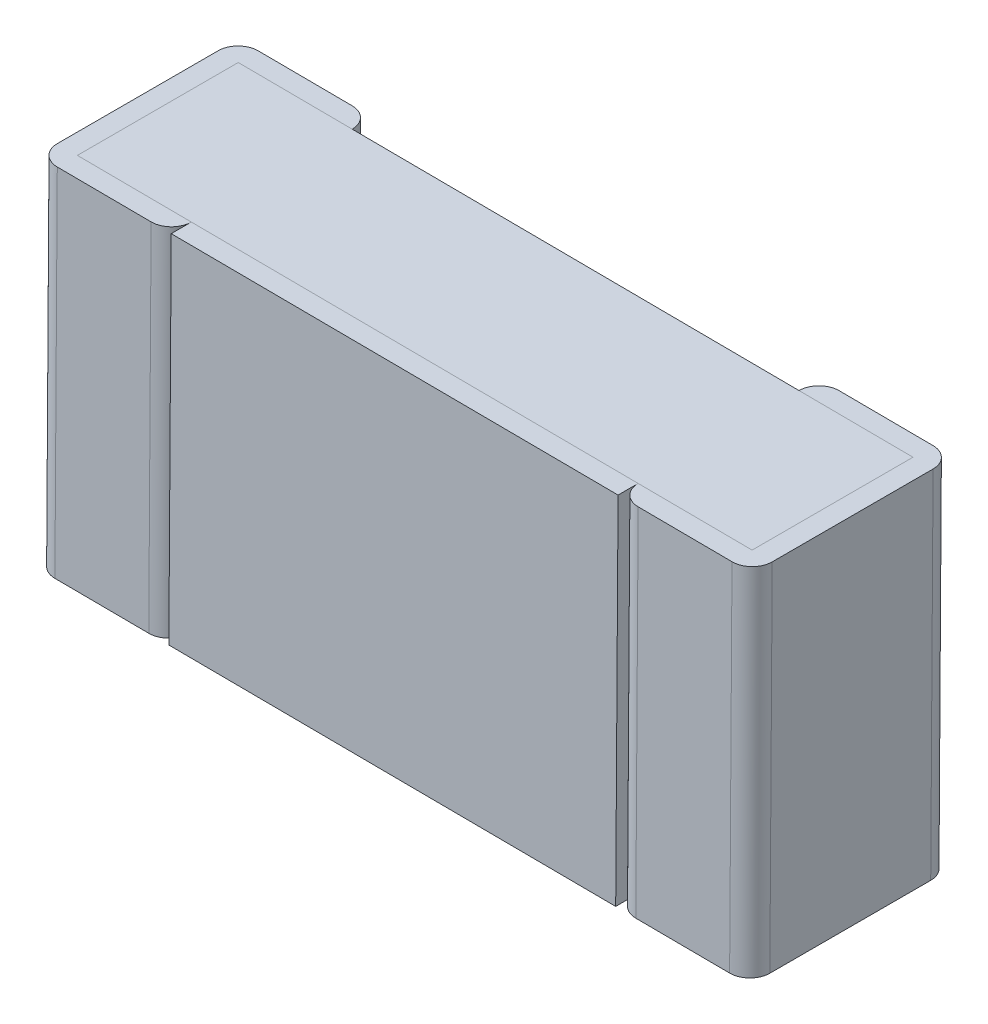
ISO-10303-21;
HEADER;
FILE_DESCRIPTION(('STEP AP214'),'2;1');
FILE_NAME('part.step','',(''),(''),'','','');
FILE_SCHEMA(('AUTOMOTIVE_DESIGN { 1 0 10303 214 1 1 1 1 }'));
ENDSEC;
DATA;
#1=APPLICATION_CONTEXT('core data for automotive mechanical design processes');
#2=APPLICATION_PROTOCOL_DEFINITION('international standard','automotive_design',2000,#1);
#3=PRODUCT_CONTEXT('',#1,'mechanical');
#4=PRODUCT('Part','Part','',(#3));
#5=PRODUCT_RELATED_PRODUCT_CATEGORY('part','',(#4));
#6=PRODUCT_DEFINITION_FORMATION('','',#4);
#7=PRODUCT_DEFINITION_CONTEXT('part definition',#1,'design');
#8=PRODUCT_DEFINITION('design','',#6,#7);
#9=PRODUCT_DEFINITION_SHAPE('','',#8);
#10=(LENGTH_UNIT() NAMED_UNIT(*) SI_UNIT(.MILLI.,.METRE.));
#11=(NAMED_UNIT(*) PLANE_ANGLE_UNIT() SI_UNIT($,.RADIAN.));
#12=(NAMED_UNIT(*) SI_UNIT($,.STERADIAN.) SOLID_ANGLE_UNIT());
#13=UNCERTAINTY_MEASURE_WITH_UNIT(LENGTH_MEASURE(1.E-05),#10,'distance_accuracy_value','');
#14=(GEOMETRIC_REPRESENTATION_CONTEXT(3) GLOBAL_UNCERTAINTY_ASSIGNED_CONTEXT((#13)) GLOBAL_UNIT_ASSIGNED_CONTEXT((#10,
#11,#12)) REPRESENTATION_CONTEXT('',''));
#15=CARTESIAN_POINT('',(0.,0.,0.));
#16=DIRECTION('',(0.,0.,1.));
#17=DIRECTION('',(1.,0.,0.));
#18=AXIS2_PLACEMENT_3D('',#15,#16,#17);
#19=CARTESIAN_POINT('',(212.780631427361,101.305639554933,142.661582908599));
#20=DIRECTION('',(0.,0.,1.));
#21=DIRECTION('',(1.,0.,0.));
#22=AXIS2_PLACEMENT_3D('',#19,#20,#21);
#23=PLANE('',#22);
#24=DIRECTION('',(0.00663069374923689,0.999978016708569,0.));
#25=VECTOR('',#24,1.);
#26=CARTESIAN_POINT('',(212.780631427361,101.305639554933,142.661582908599));
#27=LINE('',#26,#25);
#28=CARTESIAN_POINT('',(212.780631427361,101.305639554933,142.661582908599));
#29=VERTEX_POINT('',#28);
#30=CARTESIAN_POINT('',(212.785935982361,102.1056219683,142.661582908599));
#31=VERTEX_POINT('',#30);
#32=EDGE_CURVE('E66',#29,#31,#27,.T.);
#33=ORIENTED_EDGE('',*,*,#32,.F.);
#34=DIRECTION('',(0.999978016708569,-0.00663069374923689,0.));
#35=VECTOR('',#34,1.);
#36=CARTESIAN_POINT('',(212.780631427361,101.305639554933,142.661582908599));
#37=LINE('',#36,#35);
#38=CARTESIAN_POINT('',(213.780609444069,101.299008861184,142.661582908599));
#39=VERTEX_POINT('',#38);
#40=EDGE_CURVE('E11',#29,#39,#37,.T.);
#41=ORIENTED_EDGE('',*,*,#40,.T.);
#42=DIRECTION('',(0.00663069374923689,0.999978016708569,0.));
#43=VECTOR('',#42,1.);
#44=CARTESIAN_POINT('',(213.780609444069,101.299008861184,142.661582908599));
#45=LINE('',#44,#43);
#46=CARTESIAN_POINT('',(213.785913999069,102.098991274551,142.661582908599));
#47=VERTEX_POINT('',#46);
#48=EDGE_CURVE('E55',#39,#47,#45,.T.);
#49=ORIENTED_EDGE('',*,*,#48,.T.);
#50=DIRECTION('',(0.999978016708569,-0.00663069374923689,0.));
#51=VECTOR('',#50,1.);
#52=CARTESIAN_POINT('',(212.785935982361,102.1056219683,142.661582908599));
#53=LINE('',#52,#51);
#54=EDGE_CURVE('E286',#31,#47,#53,.T.);
#55=ORIENTED_EDGE('',*,*,#54,.F.);
#56=EDGE_LOOP('',(#33,#41,#49,#55));
#57=FACE_BOUND('',#56,.T.);
#58=ADVANCED_FACE('F44',(#57),#23,.T.);
#59=CARTESIAN_POINT('',(213.780609444069,101.299008861184,142.616582908599));
#60=DIRECTION('',(0.99997801670857,-0.00663069374923689,0.));
#61=DIRECTION('',(0.,0.,-1.));
#62=AXIS2_PLACEMENT_3D('',#59,#60,#61);
#63=PLANE('',#62);
#64=DIRECTION('',(0.,0.,1.));
#65=VECTOR('',#64,1.);
#66=CARTESIAN_POINT('',(213.780609444069,101.299008861184,142.616582908599));
#67=LINE('',#66,#65);
#68=CARTESIAN_POINT('',(213.780609444069,101.299008861184,142.616582908599));
#69=VERTEX_POINT('',#68);
#70=EDGE_CURVE('E160',#69,#39,#67,.T.);
#71=ORIENTED_EDGE('',*,*,#70,.F.);
#72=DIRECTION('',(0.00663069374923689,0.999978016708569,0.));
#73=VECTOR('',#72,1.);
#74=CARTESIAN_POINT('',(213.780609444069,101.299008861184,142.616582908599));
#75=LINE('',#74,#73);
#76=CARTESIAN_POINT('',(213.785913999069,102.098991274551,142.616582908599));
#77=VERTEX_POINT('',#76);
#78=EDGE_CURVE('E176',#69,#77,#75,.T.);
#79=ORIENTED_EDGE('',*,*,#78,.T.);
#80=DIRECTION('',(0.,0.,1.));
#81=VECTOR('',#80,1.);
#82=CARTESIAN_POINT('',(213.785913999069,102.098991274551,142.616582908599));
#83=LINE('',#82,#81);
#84=EDGE_CURVE('E198',#77,#47,#83,.T.);
#85=ORIENTED_EDGE('',*,*,#84,.T.);
#86=ORIENTED_EDGE('',*,*,#48,.F.);
#87=EDGE_LOOP('',(#71,#79,#85,#86));
#88=FACE_BOUND('',#87,.T.);
#89=ADVANCED_FACE('F173',(#88),#63,.T.);
#90=CARTESIAN_POINT('',(213.825608454822,101.298710479965,142.616582908599));
#91=DIRECTION('',(0.00663069374931182,0.999978016708569,0.));
#92=DIRECTION('',(-0.999978016708569,0.00663069374931182,0.));
#93=AXIS2_PLACEMENT_3D('',#90,#91,#92);
#94=CYLINDRICAL_SURFACE('',#93,0.0450000000000038);
#95=CARTESIAN_POINT('',(213.825608454822,101.298710479965,142.616582908599));
#96=DIRECTION('',(0.00663069374923689,0.99997801670857,0.));
#97=DIRECTION('',(0.,0.,1.));
#98=AXIS2_PLACEMENT_3D('',#95,#96,#97);
#99=CIRCLE('',#98,0.0449999999999895);
#100=CARTESIAN_POINT('',(213.825608454822,101.298710479965,142.661582908599));
#101=VERTEX_POINT('',#100);
#102=EDGE_CURVE('E185',#69,#101,#99,.T.);
#103=ORIENTED_EDGE('',*,*,#102,.T.);
#104=DIRECTION('',(0.00663069374923689,0.999978016708569,0.));
#105=VECTOR('',#104,1.);
#106=CARTESIAN_POINT('',(213.825608454822,101.298710479965,142.661582908599));
#107=LINE('',#106,#105);
#108=CARTESIAN_POINT('',(213.830913009821,102.098692893332,142.661582908599));
#109=VERTEX_POINT('',#108);
#110=EDGE_CURVE('E199',#101,#109,#107,.T.);
#111=ORIENTED_EDGE('',*,*,#110,.T.);
#112=CARTESIAN_POINT('',(213.830913009821,102.098692893332,142.616582908599));
#113=DIRECTION('',(0.00663069374923689,0.99997801670857,0.));
#114=DIRECTION('',(0.,0.,1.));
#115=AXIS2_PLACEMENT_3D('',#112,#113,#114);
#116=CIRCLE('',#115,0.0449999999999895);
#117=EDGE_CURVE('E203',#77,#109,#116,.T.);
#118=ORIENTED_EDGE('',*,*,#117,.F.);
#119=ORIENTED_EDGE('',*,*,#78,.F.);
#120=EDGE_LOOP('',(#103,#111,#118,#119));
#121=FACE_BOUND('',#120,.T.);
#122=ADVANCED_FACE('F202',(#121),#94,.T.);
#123=CARTESIAN_POINT('',(213.780609444069,101.299008861184,142.661582908599));
#124=DIRECTION('',(0.,0.,1.));
#125=DIRECTION('',(1.,0.,0.));
#126=AXIS2_PLACEMENT_3D('',#123,#124,#125);
#127=PLANE('',#126);
#128=DIRECTION('',(0.999978016708569,-0.00663069374923689,0.));
#129=VECTOR('',#128,1.);
#130=CARTESIAN_POINT('',(213.785913999069,102.098991274551,142.661582908599));
#131=LINE('',#130,#129);
#132=CARTESIAN_POINT('',(214.04090839333,102.097300447645,142.661582908599));
#133=VERTEX_POINT('',#132);
#134=EDGE_CURVE('E260',#109,#133,#131,.T.);
#135=ORIENTED_EDGE('',*,*,#134,.F.);
#136=ORIENTED_EDGE('',*,*,#110,.F.);
#137=DIRECTION('',(0.999978016708569,-0.00663069374923689,0.));
#138=VECTOR('',#137,1.);
#139=CARTESIAN_POINT('',(213.780609444069,101.299008861184,142.661582908599));
#140=LINE('',#139,#138);
#141=CARTESIAN_POINT('',(214.035603838331,101.297318034278,142.661582908599));
#142=VERTEX_POINT('',#141);
#143=EDGE_CURVE('E194',#101,#142,#140,.T.);
#144=ORIENTED_EDGE('',*,*,#143,.T.);
#145=DIRECTION('',(0.00663069374923689,0.999978016708569,0.));
#146=VECTOR('',#145,1.);
#147=CARTESIAN_POINT('',(214.035603838331,101.297318034278,142.661582908599));
#148=LINE('',#147,#146);
#149=EDGE_CURVE('E247',#142,#133,#148,.T.);
#150=ORIENTED_EDGE('',*,*,#149,.T.);
#151=EDGE_LOOP('',(#135,#136,#144,#150));
#152=FACE_BOUND('',#151,.T.);
#153=ADVANCED_FACE('F470',(#152),#127,.T.);
#154=CARTESIAN_POINT('',(214.035603838331,101.297318034278,142.616582908599));
#155=DIRECTION('',(0.00663069374931182,0.999978016708569,0.));
#156=DIRECTION('',(0.999978016708569,-0.00663069374931182,0.));
#157=AXIS2_PLACEMENT_3D('',#154,#155,#156);
#158=CYLINDRICAL_SURFACE('',#157,0.0450000000000038);
#159=DIRECTION('',(0.00663069374923689,0.999978016708569,0.));
#160=VECTOR('',#159,1.);
#161=CARTESIAN_POINT('',(214.080602849082,101.297019653059,142.616582908599));
#162=LINE('',#161,#160);
#163=CARTESIAN_POINT('',(214.080602849082,101.297019653059,142.616582908599));
#164=VERTEX_POINT('',#163);
#165=CARTESIAN_POINT('',(214.085907404082,102.097002066426,142.616582908599));
#166=VERTEX_POINT('',#165);
#167=EDGE_CURVE('E255',#164,#166,#162,.T.);
#168=ORIENTED_EDGE('',*,*,#167,.T.);
#169=CARTESIAN_POINT('',(214.04090839333,102.097300447645,142.616582908599));
#170=DIRECTION('',(-0.00663069374923689,-0.99997801670857,0.));
#171=DIRECTION('',(0.,0.,1.));
#172=AXIS2_PLACEMENT_3D('',#169,#170,#171);
#173=CIRCLE('',#172,0.0449999999999895);
#174=EDGE_CURVE('E312',#166,#133,#173,.T.);
#175=ORIENTED_EDGE('',*,*,#174,.T.);
#176=ORIENTED_EDGE('',*,*,#149,.F.);
#177=CARTESIAN_POINT('',(214.035603838331,101.297318034278,142.616582908599));
#178=DIRECTION('',(-0.00663069374923689,-0.99997801670857,0.));
#179=DIRECTION('',(0.,0.,1.));
#180=AXIS2_PLACEMENT_3D('',#177,#178,#179);
#181=CIRCLE('',#180,0.0449999999999895);
#182=EDGE_CURVE('E212',#164,#142,#181,.T.);
#183=ORIENTED_EDGE('',*,*,#182,.F.);
#184=EDGE_LOOP('',(#168,#175,#176,#183));
#185=FACE_BOUND('',#184,.T.);
#186=ADVANCED_FACE('F461',(#185),#158,.T.);
#187=CARTESIAN_POINT('',(214.080602849082,101.297019653059,142.211582908599));
#188=DIRECTION('',(0.99997801670857,-0.00663069374923689,0.));
#189=DIRECTION('',(0.,0.,-1.));
#190=AXIS2_PLACEMENT_3D('',#187,#188,#189);
#191=PLANE('',#190);
#192=DIRECTION('',(0.,0.,1.));
#193=VECTOR('',#192,1.);
#194=CARTESIAN_POINT('',(214.080602849082,101.297019653059,142.211582908599));
#195=LINE('',#194,#193);
#196=CARTESIAN_POINT('',(214.080602849082,101.297019653059,142.256582908599));
#197=VERTEX_POINT('',#196);
#198=EDGE_CURVE('E168',#197,#164,#195,.T.);
#199=ORIENTED_EDGE('',*,*,#198,.F.);
#200=DIRECTION('',(0.00663069374923689,0.999978016708569,0.));
#201=VECTOR('',#200,1.);
#202=CARTESIAN_POINT('',(214.080602849082,101.297019653059,142.256582908599));
#203=LINE('',#202,#201);
#204=CARTESIAN_POINT('',(214.085907404082,102.097002066426,142.256582908599));
#205=VERTEX_POINT('',#204);
#206=EDGE_CURVE('E316',#197,#205,#203,.T.);
#207=ORIENTED_EDGE('',*,*,#206,.T.);
#208=DIRECTION('',(0.,0.,1.));
#209=VECTOR('',#208,1.);
#210=CARTESIAN_POINT('',(214.085907404082,102.097002066426,142.211582908599));
#211=LINE('',#210,#209);
#212=EDGE_CURVE('E378',#205,#166,#211,.T.);
#213=ORIENTED_EDGE('',*,*,#212,.T.);
#214=ORIENTED_EDGE('',*,*,#167,.F.);
#215=EDGE_LOOP('',(#199,#207,#213,#214));
#216=FACE_BOUND('',#215,.T.);
#217=ADVANCED_FACE('F368',(#216),#191,.T.);
#218=CARTESIAN_POINT('',(214.035603838331,101.297318034278,142.256582908599));
#219=DIRECTION('',(0.00663069374931182,0.999978016708569,0.));
#220=DIRECTION('',(0.999978016708569,-0.00663069374931182,0.));
#221=AXIS2_PLACEMENT_3D('',#218,#219,#220);
#222=CYLINDRICAL_SURFACE('',#221,0.0450000000000038);
#223=CARTESIAN_POINT('',(214.035603838331,101.297318034278,142.256582908599));
#224=DIRECTION('',(0.00663069374923689,0.99997801670857,0.));
#225=DIRECTION('',(0.,0.,1.));
#226=AXIS2_PLACEMENT_3D('',#223,#224,#225);
#227=CIRCLE('',#226,0.0449999999999895);
#228=CARTESIAN_POINT('',(214.035603838331,101.297318034278,142.211582908599));
#229=VERTEX_POINT('',#228);
#230=EDGE_CURVE('E360',#197,#229,#227,.T.);
#231=ORIENTED_EDGE('',*,*,#230,.T.);
#232=DIRECTION('',(0.00663069374923689,0.999978016708569,0.));
#233=VECTOR('',#232,1.);
#234=CARTESIAN_POINT('',(214.035603838331,101.297318034278,142.211582908599));
#235=LINE('',#234,#233);
#236=CARTESIAN_POINT('',(214.04090839333,102.097300447645,142.211582908599));
#237=VERTEX_POINT('',#236);
#238=EDGE_CURVE('E386',#229,#237,#235,.T.);
#239=ORIENTED_EDGE('',*,*,#238,.T.);
#240=CARTESIAN_POINT('',(214.04090839333,102.097300447645,142.256582908599));
#241=DIRECTION('',(0.00663069374923689,0.99997801670857,0.));
#242=DIRECTION('',(0.,0.,1.));
#243=AXIS2_PLACEMENT_3D('',#240,#241,#242);
#244=CIRCLE('',#243,0.0449999999999895);
#245=EDGE_CURVE('E262',#205,#237,#244,.T.);
#246=ORIENTED_EDGE('',*,*,#245,.F.);
#247=ORIENTED_EDGE('',*,*,#206,.F.);
#248=EDGE_LOOP('',(#231,#239,#246,#247));
#249=FACE_BOUND('',#248,.T.);
#250=ADVANCED_FACE('F375',(#249),#222,.T.);
#251=CARTESIAN_POINT('',(213.780609444069,101.299008861184,142.211582908599));
#252=DIRECTION('',(0.,0.,1.));
#253=DIRECTION('',(1.,0.,0.));
#254=AXIS2_PLACEMENT_3D('',#251,#252,#253);
#255=PLANE('',#254);
#256=ORIENTED_EDGE('',*,*,#238,.F.);
#257=DIRECTION('',(0.999978016708569,-0.00663069374923689,0.));
#258=VECTOR('',#257,1.);
#259=CARTESIAN_POINT('',(213.780609444069,101.299008861184,142.211582908599));
#260=LINE('',#259,#258);
#261=CARTESIAN_POINT('',(213.825608454822,101.298710479965,142.211582908599));
#262=VERTEX_POINT('',#261);
#263=EDGE_CURVE('E221',#262,#229,#260,.T.);
#264=ORIENTED_EDGE('',*,*,#263,.F.);
#265=DIRECTION('',(0.00663069374923689,0.999978016708569,0.));
#266=VECTOR('',#265,1.);
#267=CARTESIAN_POINT('',(213.825608454822,101.298710479965,142.211582908599));
#268=LINE('',#267,#266);
#269=CARTESIAN_POINT('',(213.830913009821,102.098692893332,142.211582908599));
#270=VERTEX_POINT('',#269);
#271=EDGE_CURVE('E389',#262,#270,#268,.T.);
#272=ORIENTED_EDGE('',*,*,#271,.T.);
#273=DIRECTION('',(0.999978016708569,-0.00663069374923689,0.));
#274=VECTOR('',#273,1.);
#275=CARTESIAN_POINT('',(213.785913999069,102.098991274551,142.211582908599));
#276=LINE('',#275,#274);
#277=EDGE_CURVE('E310',#270,#237,#276,.T.);
#278=ORIENTED_EDGE('',*,*,#277,.T.);
#279=EDGE_LOOP('',(#256,#264,#272,#278));
#280=FACE_BOUND('',#279,.T.);
#281=ADVANCED_FACE('F614',(#280),#255,.F.);
#282=CARTESIAN_POINT('',(213.825608454822,101.298710479965,142.256582908599));
#283=DIRECTION('',(0.00663069374931182,0.999978016708569,0.));
#284=DIRECTION('',(-0.999978016708569,0.00663069374931182,0.));
#285=AXIS2_PLACEMENT_3D('',#282,#283,#284);
#286=CYLINDRICAL_SURFACE('',#285,0.0450000000000038);
#287=DIRECTION('',(0.00663069374923689,0.999978016708569,0.));
#288=VECTOR('',#287,1.);
#289=CARTESIAN_POINT('',(213.780609444069,101.299008861184,142.256582908599));
#290=LINE('',#289,#288);
#291=CARTESIAN_POINT('',(213.780609444069,101.299008861184,142.256582908599));
#292=VERTEX_POINT('',#291);
#293=CARTESIAN_POINT('',(213.785913999069,102.098991274551,142.256582908599));
#294=VERTEX_POINT('',#293);
#295=EDGE_CURVE('E306',#292,#294,#290,.T.);
#296=ORIENTED_EDGE('',*,*,#295,.T.);
#297=CARTESIAN_POINT('',(213.830913009821,102.098692893332,142.256582908599));
#298=DIRECTION('',(-0.00663069374923689,-0.99997801670857,0.));
#299=DIRECTION('',(0.,0.,1.));
#300=AXIS2_PLACEMENT_3D('',#297,#298,#299);
#301=CIRCLE('',#300,0.0449999999999895);
#302=EDGE_CURVE('E311',#294,#270,#301,.T.);
#303=ORIENTED_EDGE('',*,*,#302,.T.);
#304=ORIENTED_EDGE('',*,*,#271,.F.);
#305=CARTESIAN_POINT('',(213.825608454822,101.298710479965,142.256582908599));
#306=DIRECTION('',(-0.00663069374923689,-0.99997801670857,0.));
#307=DIRECTION('',(0.,0.,1.));
#308=AXIS2_PLACEMENT_3D('',#305,#306,#307);
#309=CIRCLE('',#308,0.0449999999999895);
#310=EDGE_CURVE('E213',#292,#262,#309,.T.);
#311=ORIENTED_EDGE('',*,*,#310,.F.);
#312=EDGE_LOOP('',(#296,#303,#304,#311));
#313=FACE_BOUND('',#312,.T.);
#314=ADVANCED_FACE('F497',(#313),#286,.T.);
#315=CARTESIAN_POINT('',(212.785935982361,102.1056219683,142.616582908599));
#316=DIRECTION('',(0.00663069374923689,0.99997801670857,0.));
#317=DIRECTION('',(0.,0.,-1.));
#318=AXIS2_PLACEMENT_3D('',#315,#316,#317);
#319=PLANE('',#318);
#320=DIRECTION('',(0.999978016708569,-0.00663069374923689,0.));
#321=VECTOR('',#320,1.);
#322=CARTESIAN_POINT('',(212.785935982361,102.1056219683,142.616582908599));
#323=LINE('',#322,#321);
#324=CARTESIAN_POINT('',(212.785935982361,102.1056219683,142.616582908599));
#325=VERTEX_POINT('',#324);
#326=EDGE_CURVE('E400',#325,#77,#323,.T.);
#327=ORIENTED_EDGE('',*,*,#326,.F.);
#328=DIRECTION('',(0.,0.,1.));
#329=VECTOR('',#328,1.);
#330=CARTESIAN_POINT('',(212.785935982361,102.1056219683,142.616582908599));
#331=LINE('',#330,#329);
#332=EDGE_CURVE('E287',#325,#31,#331,.T.);
#333=ORIENTED_EDGE('',*,*,#332,.T.);
#334=ORIENTED_EDGE('',*,*,#54,.T.);
#335=ORIENTED_EDGE('',*,*,#84,.F.);
#336=EDGE_LOOP('',(#327,#333,#334,#335));
#337=FACE_BOUND('',#336,.T.);
#338=ADVANCED_FACE('F494',(#337),#319,.T.);
#339=CARTESIAN_POINT('',(213.785913999069,102.098991274551,142.211582908599));
#340=DIRECTION('',(0.00663069374923689,0.99997801670857,0.));
#341=DIRECTION('',(0.,0.,-1.));
#342=AXIS2_PLACEMENT_3D('',#339,#340,#341);
#343=PLANE('',#342);
#344=ORIENTED_EDGE('',*,*,#277,.F.);
#345=ORIENTED_EDGE('',*,*,#302,.F.);
#346=DIRECTION('',(0.999978016708569,-0.00663069374923689,0.));
#347=VECTOR('',#346,1.);
#348=CARTESIAN_POINT('',(212.530941588099,102.107312795206,142.256582908599));
#349=LINE('',#348,#347);
#350=CARTESIAN_POINT('',(214.04090839333,102.097300447645,142.256582908599));
#351=VERTEX_POINT('',#350);
#352=EDGE_CURVE('E288',#294,#351,#349,.T.);
#353=ORIENTED_EDGE('',*,*,#352,.T.);
#354=DIRECTION('',(0.,0.,1.));
#355=VECTOR('',#354,1.);
#356=CARTESIAN_POINT('',(214.04090839333,102.097300447645,142.256582908599));
#357=LINE('',#356,#355);
#358=CARTESIAN_POINT('',(214.04090839333,102.097300447645,142.616582908599));
#359=VERTEX_POINT('',#358);
#360=EDGE_CURVE('E331',#351,#359,#357,.T.);
#361=ORIENTED_EDGE('',*,*,#360,.T.);
#362=DIRECTION('',(0.999978016708569,-0.00663069374923689,0.));
#363=VECTOR('',#362,1.);
#364=CARTESIAN_POINT('',(212.530941588099,102.107312795206,142.616582908599));
#365=LINE('',#364,#363);
#366=EDGE_CURVE('E415',#77,#359,#365,.T.);
#367=ORIENTED_EDGE('',*,*,#366,.F.);
#368=ORIENTED_EDGE('',*,*,#117,.T.);
#369=ORIENTED_EDGE('',*,*,#134,.T.);
#370=ORIENTED_EDGE('',*,*,#174,.F.);
#371=ORIENTED_EDGE('',*,*,#212,.F.);
#372=ORIENTED_EDGE('',*,*,#245,.T.);
#373=EDGE_LOOP('',(#344,#345,#353,#361,#367,#368,#369,#370,#371,#372));
#374=FACE_BOUND('',#373,.T.);
#375=ADVANCED_FACE('F466',(#374),#343,.T.);
#376=CARTESIAN_POINT('',(212.780631427361,101.305639554933,142.616582908599));
#377=DIRECTION('',(0.99997801670857,-0.00663069374923689,0.));
#378=DIRECTION('',(0.,0.,-1.));
#379=AXIS2_PLACEMENT_3D('',#376,#377,#378);
#380=PLANE('',#379);
#381=ORIENTED_EDGE('',*,*,#32,.T.);
#382=ORIENTED_EDGE('',*,*,#332,.F.);
#383=DIRECTION('',(0.00663069374923689,0.999978016708569,0.));
#384=VECTOR('',#383,1.);
#385=CARTESIAN_POINT('',(212.780631427361,101.305639554933,142.616582908599));
#386=LINE('',#385,#384);
#387=CARTESIAN_POINT('',(212.780631427361,101.305639554933,142.616582908599));
#388=VERTEX_POINT('',#387);
#389=EDGE_CURVE('E406',#388,#325,#386,.T.);
#390=ORIENTED_EDGE('',*,*,#389,.F.);
#391=DIRECTION('',(0.,0.,1.));
#392=VECTOR('',#391,1.);
#393=CARTESIAN_POINT('',(212.780631427361,101.305639554933,142.616582908599));
#394=LINE('',#393,#392);
#395=EDGE_CURVE('E162',#388,#29,#394,.T.);
#396=ORIENTED_EDGE('',*,*,#395,.T.);
#397=EDGE_LOOP('',(#381,#382,#390,#396));
#398=FACE_BOUND('',#397,.T.);
#399=ADVANCED_FACE('F493',(#398),#380,.F.);
#400=CARTESIAN_POINT('',(212.780631427361,101.305639554933,142.616582908599));
#401=DIRECTION('',(0.00663069374923689,0.99997801670857,0.));
#402=DIRECTION('',(0.,0.,-1.));
#403=AXIS2_PLACEMENT_3D('',#400,#401,#402);
#404=PLANE('',#403);
#405=ORIENTED_EDGE('',*,*,#70,.T.);
#406=ORIENTED_EDGE('',*,*,#40,.F.);
#407=ORIENTED_EDGE('',*,*,#395,.F.);
#408=DIRECTION('',(0.999978016708569,-0.00663069374923689,0.));
#409=VECTOR('',#408,1.);
#410=CARTESIAN_POINT('',(212.780631427361,101.305639554933,142.616582908599));
#411=LINE('',#410,#409);
#412=EDGE_CURVE('E157',#388,#69,#411,.T.);
#413=ORIENTED_EDGE('',*,*,#412,.T.);
#414=EDGE_LOOP('',(#405,#406,#407,#413));
#415=FACE_BOUND('',#414,.T.);
#416=ADVANCED_FACE('F159',(#415),#404,.F.);
#417=CARTESIAN_POINT('',(213.780609444069,101.299008861184,142.211582908599));
#418=DIRECTION('',(0.00663069374923689,0.99997801670857,0.));
#419=DIRECTION('',(0.,0.,-1.));
#420=AXIS2_PLACEMENT_3D('',#417,#418,#419);
#421=PLANE('',#420);
#422=ORIENTED_EDGE('',*,*,#230,.F.);
#423=ORIENTED_EDGE('',*,*,#198,.T.);
#424=ORIENTED_EDGE('',*,*,#182,.T.);
#425=ORIENTED_EDGE('',*,*,#143,.F.);
#426=ORIENTED_EDGE('',*,*,#102,.F.);
#427=DIRECTION('',(0.999978016708569,-0.00663069374923689,0.));
#428=VECTOR('',#427,1.);
#429=CARTESIAN_POINT('',(212.5256370331,101.307330381839,142.616582908599));
#430=LINE('',#429,#428);
#431=CARTESIAN_POINT('',(214.035603838331,101.297318034278,142.616582908599));
#432=VERTEX_POINT('',#431);
#433=EDGE_CURVE('E190',#69,#432,#430,.T.);
#434=ORIENTED_EDGE('',*,*,#433,.T.);
#435=DIRECTION('',(0.,0.,1.));
#436=VECTOR('',#435,1.);
#437=CARTESIAN_POINT('',(214.035603838331,101.297318034278,142.256582908599));
#438=LINE('',#437,#436);
#439=CARTESIAN_POINT('',(214.035603838331,101.297318034278,142.256582908599));
#440=VERTEX_POINT('',#439);
#441=EDGE_CURVE('E210',#440,#432,#438,.T.);
#442=ORIENTED_EDGE('',*,*,#441,.F.);
#443=DIRECTION('',(0.999978016708569,-0.00663069374923689,0.));
#444=VECTOR('',#443,1.);
#445=CARTESIAN_POINT('',(212.5256370331,101.307330381839,142.256582908599));
#446=LINE('',#445,#444);
#447=EDGE_CURVE('E332',#292,#440,#446,.T.);
#448=ORIENTED_EDGE('',*,*,#447,.F.);
#449=ORIENTED_EDGE('',*,*,#310,.T.);
#450=ORIENTED_EDGE('',*,*,#263,.T.);
#451=EDGE_LOOP('',(#422,#423,#424,#425,#426,#434,#442,#448,#449,#450));
#452=FACE_BOUND('',#451,.T.);
#453=ADVANCED_FACE('F187',(#452),#421,.F.);
#454=CARTESIAN_POINT('',(212.5256370331,101.307330381839,142.256582908599));
#455=DIRECTION('',(0.,0.,1.));
#456=DIRECTION('',(1.,0.,0.));
#457=AXIS2_PLACEMENT_3D('',#454,#455,#456);
#458=PLANE('',#457);
#459=DIRECTION('',(0.999978016708569,-0.00663069374923689,0.));
#460=VECTOR('',#459,1.);
#461=CARTESIAN_POINT('',(212.530941588099,102.107312795206,142.256582908599));
#462=LINE('',#461,#460);
#463=CARTESIAN_POINT('',(212.785935982361,102.1056219683,142.256582908599));
#464=VERTEX_POINT('',#463);
#465=EDGE_CURVE('E228',#464,#294,#462,.T.);
#466=ORIENTED_EDGE('',*,*,#465,.T.);
#467=ORIENTED_EDGE('',*,*,#295,.F.);
#468=DIRECTION('',(0.999978016708569,-0.00663069374923689,0.));
#469=VECTOR('',#468,1.);
#470=CARTESIAN_POINT('',(212.5256370331,101.307330381839,142.256582908599));
#471=LINE('',#470,#469);
#472=CARTESIAN_POINT('',(212.780631427361,101.305639554933,142.256582908599));
#473=VERTEX_POINT('',#472);
#474=EDGE_CURVE('E335',#473,#292,#471,.T.);
#475=ORIENTED_EDGE('',*,*,#474,.F.);
#476=DIRECTION('',(0.00663069374923689,0.999978016708569,0.));
#477=VECTOR('',#476,1.);
#478=CARTESIAN_POINT('',(212.780631427361,101.305639554933,142.256582908599));
#479=LINE('',#478,#477);
#480=EDGE_CURVE('E225',#473,#464,#479,.T.);
#481=ORIENTED_EDGE('',*,*,#480,.T.);
#482=EDGE_LOOP('',(#466,#467,#475,#481));
#483=FACE_BOUND('',#482,.T.);
#484=ADVANCED_FACE('F506',(#483),#458,.F.);
#485=CARTESIAN_POINT('',(212.530941588099,102.107312795206,142.256582908599));
#486=DIRECTION('',(0.00663069374923689,0.99997801670857,0.));
#487=DIRECTION('',(0.,0.,-1.));
#488=AXIS2_PLACEMENT_3D('',#485,#486,#487);
#489=PLANE('',#488);
#490=DIRECTION('',(0.999978016708569,-0.00663069374923689,0.));
#491=VECTOR('',#490,1.);
#492=CARTESIAN_POINT('',(212.530941588099,102.107312795206,142.256582908599));
#493=LINE('',#492,#491);
#494=CARTESIAN_POINT('',(212.530941588099,102.107312795206,142.256582908599));
#495=VERTEX_POINT('',#494);
#496=EDGE_CURVE('E423',#495,#464,#493,.T.);
#497=ORIENTED_EDGE('',*,*,#496,.F.);
#498=DIRECTION('',(0.,0.,1.));
#499=VECTOR('',#498,1.);
#500=CARTESIAN_POINT('',(212.530941588099,102.107312795206,142.256582908599));
#501=LINE('',#500,#499);
#502=CARTESIAN_POINT('',(212.530941588099,102.107312795206,142.616582908599));
#503=VERTEX_POINT('',#502);
#504=EDGE_CURVE('E229',#495,#503,#501,.T.);
#505=ORIENTED_EDGE('',*,*,#504,.T.);
#506=DIRECTION('',(0.999978016708569,-0.00663069374923689,0.));
#507=VECTOR('',#506,1.);
#508=CARTESIAN_POINT('',(212.530941588099,102.107312795206,142.616582908599));
#509=LINE('',#508,#507);
#510=EDGE_CURVE('E305',#503,#325,#509,.T.);
#511=ORIENTED_EDGE('',*,*,#510,.T.);
#512=ORIENTED_EDGE('',*,*,#326,.T.);
#513=ORIENTED_EDGE('',*,*,#366,.T.);
#514=ORIENTED_EDGE('',*,*,#360,.F.);
#515=ORIENTED_EDGE('',*,*,#352,.F.);
#516=ORIENTED_EDGE('',*,*,#465,.F.);
#517=EDGE_LOOP('',(#497,#505,#511,#512,#513,#514,#515,#516));
#518=FACE_BOUND('',#517,.T.);
#519=ADVANCED_FACE('F515',(#518),#489,.T.);
#520=CARTESIAN_POINT('',(212.735632416609,101.305937936152,142.616582908599));
#521=DIRECTION('',(0.00663069374931182,0.999978016708569,0.));
#522=DIRECTION('',(0.999978016708569,-0.00663069374931182,0.));
#523=AXIS2_PLACEMENT_3D('',#520,#521,#522);
#524=CYLINDRICAL_SURFACE('',#523,0.0450000000000038);
#525=ORIENTED_EDGE('',*,*,#389,.T.);
#526=CARTESIAN_POINT('',(212.740936971609,102.105920349519,142.616582908599));
#527=DIRECTION('',(-0.00663069374923689,-0.99997801670857,0.));
#528=DIRECTION('',(0.,0.,1.));
#529=AXIS2_PLACEMENT_3D('',#526,#527,#528);
#530=CIRCLE('',#529,0.0449999999999895);
#531=CARTESIAN_POINT('',(212.740936971609,102.105920349519,142.661582908599));
#532=VERTEX_POINT('',#531);
#533=EDGE_CURVE('E294',#325,#532,#530,.T.);
#534=ORIENTED_EDGE('',*,*,#533,.T.);
#535=DIRECTION('',(0.00663069374923689,0.999978016708569,0.));
#536=VECTOR('',#535,1.);
#537=CARTESIAN_POINT('',(212.735632416609,101.305937936152,142.661582908599));
#538=LINE('',#537,#536);
#539=CARTESIAN_POINT('',(212.735632416609,101.305937936152,142.661582908599));
#540=VERTEX_POINT('',#539);
#541=EDGE_CURVE('E295',#540,#532,#538,.T.);
#542=ORIENTED_EDGE('',*,*,#541,.F.);
#543=CARTESIAN_POINT('',(212.735632416609,101.305937936152,142.616582908599));
#544=DIRECTION('',(-0.00663069374923689,-0.99997801670857,0.));
#545=DIRECTION('',(0.,0.,1.));
#546=AXIS2_PLACEMENT_3D('',#543,#544,#545);
#547=CIRCLE('',#546,0.0449999999999895);
#548=EDGE_CURVE('E276',#388,#540,#547,.T.);
#549=ORIENTED_EDGE('',*,*,#548,.F.);
#550=EDGE_LOOP('',(#525,#534,#542,#549));
#551=FACE_BOUND('',#550,.T.);
#552=ADVANCED_FACE('F489',(#551),#524,.T.);
#553=CARTESIAN_POINT('',(212.480638022349,101.307628763058,142.661582908599));
#554=DIRECTION('',(0.,0.,1.));
#555=DIRECTION('',(1.,0.,0.));
#556=AXIS2_PLACEMENT_3D('',#553,#554,#555);
#557=PLANE('',#556);
#558=DIRECTION('',(0.999978016708569,-0.00663069374923689,0.));
#559=VECTOR('',#558,1.);
#560=CARTESIAN_POINT('',(212.485942577348,102.107611176425,142.661582908599));
#561=LINE('',#560,#559);
#562=CARTESIAN_POINT('',(212.530941588099,102.107312795206,142.661582908599));
#563=VERTEX_POINT('',#562);
#564=EDGE_CURVE('E322',#563,#532,#561,.T.);
#565=ORIENTED_EDGE('',*,*,#564,.F.);
#566=DIRECTION('',(0.00663069374923689,0.999978016708569,0.));
#567=VECTOR('',#566,1.);
#568=CARTESIAN_POINT('',(212.5256370331,101.307330381839,142.661582908599));
#569=LINE('',#568,#567);
#570=CARTESIAN_POINT('',(212.5256370331,101.307330381839,142.661582908599));
#571=VERTEX_POINT('',#570);
#572=EDGE_CURVE('E234',#571,#563,#569,.T.);
#573=ORIENTED_EDGE('',*,*,#572,.F.);
#574=DIRECTION('',(0.999978016708569,-0.00663069374923689,0.));
#575=VECTOR('',#574,1.);
#576=CARTESIAN_POINT('',(212.480638022349,101.307628763058,142.661582908599));
#577=LINE('',#576,#575);
#578=EDGE_CURVE('E290',#571,#540,#577,.T.);
#579=ORIENTED_EDGE('',*,*,#578,.T.);
#580=ORIENTED_EDGE('',*,*,#541,.T.);
#581=EDGE_LOOP('',(#565,#573,#579,#580));
#582=FACE_BOUND('',#581,.T.);
#583=ADVANCED_FACE('F507',(#582),#557,.T.);
#584=CARTESIAN_POINT('',(212.5256370331,101.307330381839,142.256582908599));
#585=DIRECTION('',(0.00663069374923689,0.99997801670857,0.));
#586=DIRECTION('',(0.,0.,-1.));
#587=AXIS2_PLACEMENT_3D('',#584,#585,#586);
#588=PLANE('',#587);
#589=ORIENTED_EDGE('',*,*,#474,.T.);
#590=ORIENTED_EDGE('',*,*,#447,.T.);
#591=ORIENTED_EDGE('',*,*,#441,.T.);
#592=ORIENTED_EDGE('',*,*,#433,.F.);
#593=ORIENTED_EDGE('',*,*,#412,.F.);
#594=DIRECTION('',(0.999978016708569,-0.00663069374923689,0.));
#595=VECTOR('',#594,1.);
#596=CARTESIAN_POINT('',(212.5256370331,101.307330381839,142.616582908599));
#597=LINE('',#596,#595);
#598=CARTESIAN_POINT('',(212.5256370331,101.307330381839,142.616582908599));
#599=VERTEX_POINT('',#598);
#600=EDGE_CURVE('E266',#599,#388,#597,.T.);
#601=ORIENTED_EDGE('',*,*,#600,.F.);
#602=DIRECTION('',(0.,0.,1.));
#603=VECTOR('',#602,1.);
#604=CARTESIAN_POINT('',(212.5256370331,101.307330381839,142.256582908599));
#605=LINE('',#604,#603);
#606=CARTESIAN_POINT('',(212.5256370331,101.307330381839,142.256582908599));
#607=VERTEX_POINT('',#606);
#608=EDGE_CURVE('E263',#607,#599,#605,.T.);
#609=ORIENTED_EDGE('',*,*,#608,.F.);
#610=DIRECTION('',(0.999978016708569,-0.00663069374923689,0.));
#611=VECTOR('',#610,1.);
#612=CARTESIAN_POINT('',(212.5256370331,101.307330381839,142.256582908599));
#613=LINE('',#612,#611);
#614=EDGE_CURVE('E299',#607,#473,#613,.T.);
#615=ORIENTED_EDGE('',*,*,#614,.T.);
#616=EDGE_LOOP('',(#589,#590,#591,#592,#593,#601,#609,#615));
#617=FACE_BOUND('',#616,.T.);
#618=ADVANCED_FACE('F208',(#617),#588,.F.);
#619=CARTESIAN_POINT('',(212.735632416609,101.305937936152,142.256582908599));
#620=DIRECTION('',(0.00663069374931182,0.999978016708569,0.));
#621=DIRECTION('',(0.999978016708569,-0.00663069374931182,0.));
#622=AXIS2_PLACEMENT_3D('',#619,#620,#621);
#623=CYLINDRICAL_SURFACE('',#622,0.0450000000000038);
#624=CARTESIAN_POINT('',(212.735632416609,101.305937936152,142.256582908599));
#625=DIRECTION('',(0.00663069374923689,0.99997801670857,0.));
#626=DIRECTION('',(0.,0.,1.));
#627=AXIS2_PLACEMENT_3D('',#624,#625,#626);
#628=CIRCLE('',#627,0.0449999999999895);
#629=CARTESIAN_POINT('',(212.735632416609,101.305937936152,142.211582908599));
#630=VERTEX_POINT('',#629);
#631=EDGE_CURVE('E296',#473,#630,#628,.T.);
#632=ORIENTED_EDGE('',*,*,#631,.T.);
#633=DIRECTION('',(0.00663069374923689,0.999978016708569,0.));
#634=VECTOR('',#633,1.);
#635=CARTESIAN_POINT('',(212.735632416609,101.305937936152,142.211582908599));
#636=LINE('',#635,#634);
#637=CARTESIAN_POINT('',(212.740936971609,102.105920349519,142.211582908599));
#638=VERTEX_POINT('',#637);
#639=EDGE_CURVE('E300',#630,#638,#636,.T.);
#640=ORIENTED_EDGE('',*,*,#639,.T.);
#641=CARTESIAN_POINT('',(212.740936971609,102.105920349519,142.256582908599));
#642=DIRECTION('',(0.00663069374923689,0.99997801670857,0.));
#643=DIRECTION('',(0.,0.,1.));
#644=AXIS2_PLACEMENT_3D('',#641,#642,#643);
#645=CIRCLE('',#644,0.0449999999999895);
#646=EDGE_CURVE('E259',#464,#638,#645,.T.);
#647=ORIENTED_EDGE('',*,*,#646,.F.);
#648=ORIENTED_EDGE('',*,*,#480,.F.);
#649=EDGE_LOOP('',(#632,#640,#647,#648));
#650=FACE_BOUND('',#649,.T.);
#651=ADVANCED_FACE('F46',(#650),#623,.T.);
#652=CARTESIAN_POINT('',(212.480638022349,101.307628763058,142.211582908599));
#653=DIRECTION('',(0.,0.,1.));
#654=DIRECTION('',(1.,0.,0.));
#655=AXIS2_PLACEMENT_3D('',#652,#653,#654);
#656=PLANE('',#655);
#657=ORIENTED_EDGE('',*,*,#639,.F.);
#658=DIRECTION('',(0.999978016708569,-0.00663069374923689,0.));
#659=VECTOR('',#658,1.);
#660=CARTESIAN_POINT('',(212.480638022349,101.307628763058,142.211582908599));
#661=LINE('',#660,#659);
#662=CARTESIAN_POINT('',(212.5256370331,101.307330381839,142.211582908599));
#663=VERTEX_POINT('',#662);
#664=EDGE_CURVE('E411',#663,#630,#661,.T.);
#665=ORIENTED_EDGE('',*,*,#664,.F.);
#666=DIRECTION('',(0.00663069374923689,0.999978016708569,0.));
#667=VECTOR('',#666,1.);
#668=CARTESIAN_POINT('',(212.5256370331,101.307330381839,142.211582908599));
#669=LINE('',#668,#667);
#670=CARTESIAN_POINT('',(212.530941588099,102.107312795206,142.211582908599));
#671=VERTEX_POINT('',#670);
#672=EDGE_CURVE('E341',#663,#671,#669,.T.);
#673=ORIENTED_EDGE('',*,*,#672,.T.);
#674=DIRECTION('',(0.999978016708569,-0.00663069374923689,0.));
#675=VECTOR('',#674,1.);
#676=CARTESIAN_POINT('',(212.485942577348,102.107611176425,142.211582908599));
#677=LINE('',#676,#675);
#678=EDGE_CURVE('E345',#671,#638,#677,.T.);
#679=ORIENTED_EDGE('',*,*,#678,.T.);
#680=EDGE_LOOP('',(#657,#665,#673,#679));
#681=FACE_BOUND('',#680,.T.);
#682=ADVANCED_FACE('F599',(#681),#656,.F.);
#683=CARTESIAN_POINT('',(212.485942577348,102.107611176425,142.211582908599));
#684=DIRECTION('',(0.00663069374923689,0.99997801670857,0.));
#685=DIRECTION('',(0.,0.,-1.));
#686=AXIS2_PLACEMENT_3D('',#683,#684,#685);
#687=PLANE('',#686);
#688=ORIENTED_EDGE('',*,*,#678,.F.);
#689=CARTESIAN_POINT('',(212.530941588099,102.107312795206,142.256582908599));
#690=DIRECTION('',(-0.00663069374923689,-0.99997801670857,0.));
#691=DIRECTION('',(0.,0.,1.));
#692=AXIS2_PLACEMENT_3D('',#689,#690,#691);
#693=CIRCLE('',#692,0.0449999999999895);
#694=CARTESIAN_POINT('',(212.485942577348,102.107611176425,142.256582908599));
#695=VERTEX_POINT('',#694);
#696=EDGE_CURVE('E235',#695,#671,#693,.T.);
#697=ORIENTED_EDGE('',*,*,#696,.F.);
#698=DIRECTION('',(0.,0.,1.));
#699=VECTOR('',#698,1.);
#700=CARTESIAN_POINT('',(212.485942577348,102.107611176425,142.211582908599));
#701=LINE('',#700,#699);
#702=CARTESIAN_POINT('',(212.485942577348,102.107611176425,142.616582908599));
#703=VERTEX_POINT('',#702);
#704=EDGE_CURVE('E321',#695,#703,#701,.T.);
#705=ORIENTED_EDGE('',*,*,#704,.T.);
#706=CARTESIAN_POINT('',(212.530941588099,102.107312795206,142.616582908599));
#707=DIRECTION('',(0.00663069374923689,0.99997801670857,0.));
#708=DIRECTION('',(0.,0.,1.));
#709=AXIS2_PLACEMENT_3D('',#706,#707,#708);
#710=CIRCLE('',#709,0.0449999999999895);
#711=EDGE_CURVE('E317',#703,#563,#710,.T.);
#712=ORIENTED_EDGE('',*,*,#711,.T.);
#713=ORIENTED_EDGE('',*,*,#564,.T.);
#714=ORIENTED_EDGE('',*,*,#533,.F.);
#715=ORIENTED_EDGE('',*,*,#510,.F.);
#716=ORIENTED_EDGE('',*,*,#504,.F.);
#717=ORIENTED_EDGE('',*,*,#496,.T.);
#718=ORIENTED_EDGE('',*,*,#646,.T.);
#719=EDGE_LOOP('',(#688,#697,#705,#712,#713,#714,#715,#716,#717,#718));
#720=FACE_BOUND('',#719,.T.);
#721=ADVANCED_FACE('F503',(#720),#687,.T.);
#722=CARTESIAN_POINT('',(212.5256370331,101.307330381839,142.616582908599));
#723=DIRECTION('',(0.00663069374931182,0.999978016708569,0.));
#724=DIRECTION('',(-0.999978016708569,0.00663069374931182,0.));
#725=AXIS2_PLACEMENT_3D('',#722,#723,#724);
#726=CYLINDRICAL_SURFACE('',#725,0.0450000000000038);
#727=CARTESIAN_POINT('',(212.5256370331,101.307330381839,142.616582908599));
#728=DIRECTION('',(0.00663069374923689,0.99997801670857,0.));
#729=DIRECTION('',(0.,0.,1.));
#730=AXIS2_PLACEMENT_3D('',#727,#728,#729);
#731=CIRCLE('',#730,0.0449999999999895);
#732=CARTESIAN_POINT('',(212.480638022349,101.307628763058,142.616582908599));
#733=VERTEX_POINT('',#732);
#734=EDGE_CURVE('E240',#733,#571,#731,.T.);
#735=ORIENTED_EDGE('',*,*,#734,.T.);
#736=ORIENTED_EDGE('',*,*,#572,.T.);
#737=ORIENTED_EDGE('',*,*,#711,.F.);
#738=DIRECTION('',(0.00663069374923689,0.999978016708569,0.));
#739=VECTOR('',#738,1.);
#740=CARTESIAN_POINT('',(212.480638022349,101.307628763058,142.616582908599));
#741=LINE('',#740,#739);
#742=EDGE_CURVE('E407',#733,#703,#741,.T.);
#743=ORIENTED_EDGE('',*,*,#742,.F.);
#744=EDGE_LOOP('',(#735,#736,#737,#743));
#745=FACE_BOUND('',#744,.T.);
#746=ADVANCED_FACE('F499',(#745),#726,.T.);
#747=CARTESIAN_POINT('',(212.5256370331,101.307330381839,142.256582908599));
#748=DIRECTION('',(0.00663069374931182,0.999978016708569,0.));
#749=DIRECTION('',(-0.999978016708569,0.00663069374931182,0.));
#750=AXIS2_PLACEMENT_3D('',#747,#748,#749);
#751=CYLINDRICAL_SURFACE('',#750,0.0450000000000038);
#752=DIRECTION('',(0.00663069374923689,0.999978016708569,0.));
#753=VECTOR('',#752,1.);
#754=CARTESIAN_POINT('',(212.480638022349,101.307628763058,142.256582908599));
#755=LINE('',#754,#753);
#756=CARTESIAN_POINT('',(212.480638022349,101.307628763058,142.256582908599));
#757=VERTEX_POINT('',#756);
#758=EDGE_CURVE('E230',#757,#695,#755,.T.);
#759=ORIENTED_EDGE('',*,*,#758,.T.);
#760=ORIENTED_EDGE('',*,*,#696,.T.);
#761=ORIENTED_EDGE('',*,*,#672,.F.);
#762=CARTESIAN_POINT('',(212.5256370331,101.307330381839,142.256582908599));
#763=DIRECTION('',(-0.00663069374923689,-0.99997801670857,0.));
#764=DIRECTION('',(0.,0.,1.));
#765=AXIS2_PLACEMENT_3D('',#762,#763,#764);
#766=CIRCLE('',#765,0.0449999999999895);
#767=EDGE_CURVE('E48',#757,#663,#766,.T.);
#768=ORIENTED_EDGE('',*,*,#767,.F.);
#769=EDGE_LOOP('',(#759,#760,#761,#768));
#770=FACE_BOUND('',#769,.T.);
#771=ADVANCED_FACE('F502',(#770),#751,.T.);
#772=CARTESIAN_POINT('',(212.480638022349,101.307628763058,142.211582908599));
#773=DIRECTION('',(0.00663069374923689,0.99997801670857,0.));
#774=DIRECTION('',(0.,0.,-1.));
#775=AXIS2_PLACEMENT_3D('',#772,#773,#774);
#776=PLANE('',#775);
#777=ORIENTED_EDGE('',*,*,#631,.F.);
#778=ORIENTED_EDGE('',*,*,#614,.F.);
#779=ORIENTED_EDGE('',*,*,#608,.T.);
#780=ORIENTED_EDGE('',*,*,#600,.T.);
#781=ORIENTED_EDGE('',*,*,#548,.T.);
#782=ORIENTED_EDGE('',*,*,#578,.F.);
#783=ORIENTED_EDGE('',*,*,#734,.F.);
#784=DIRECTION('',(0.,0.,1.));
#785=VECTOR('',#784,1.);
#786=CARTESIAN_POINT('',(212.480638022349,101.307628763058,142.211582908599));
#787=LINE('',#786,#785);
#788=EDGE_CURVE('E412',#757,#733,#787,.T.);
#789=ORIENTED_EDGE('',*,*,#788,.F.);
#790=ORIENTED_EDGE('',*,*,#767,.T.);
#791=ORIENTED_EDGE('',*,*,#664,.T.);
#792=EDGE_LOOP('',(#777,#778,#779,#780,#781,#782,#783,#789,#790,#791));
#793=FACE_BOUND('',#792,.T.);
#794=ADVANCED_FACE('F532',(#793),#776,.F.);
#795=CARTESIAN_POINT('',(212.480638022349,101.307628763058,142.211582908599));
#796=DIRECTION('',(0.99997801670857,-0.00663069374923689,0.));
#797=DIRECTION('',(0.,0.,-1.));
#798=AXIS2_PLACEMENT_3D('',#795,#796,#797);
#799=PLANE('',#798);
#800=ORIENTED_EDGE('',*,*,#742,.T.);
#801=ORIENTED_EDGE('',*,*,#704,.F.);
#802=ORIENTED_EDGE('',*,*,#758,.F.);
#803=ORIENTED_EDGE('',*,*,#788,.T.);
#804=EDGE_LOOP('',(#800,#801,#802,#803));
#805=FACE_BOUND('',#804,.T.);
#806=ADVANCED_FACE('F539',(#805),#799,.F.);
#807=CLOSED_SHELL('',(#58,#89,#122,#153,#186,#217,#250,#281,#314,#338,#375,#399,#416,#453,#484,
#519,#552,#583,#618,#651,#682,#721,#746,#771,#794,#806));
#808=MANIFOLD_SOLID_BREP('B2',#807);
#809=ADVANCED_BREP_SHAPE_REPRESENTATION('',(#18,#808),#14);
#810=SHAPE_DEFINITION_REPRESENTATION(#9,#809);
ENDSEC;
END-ISO-10303-21;
